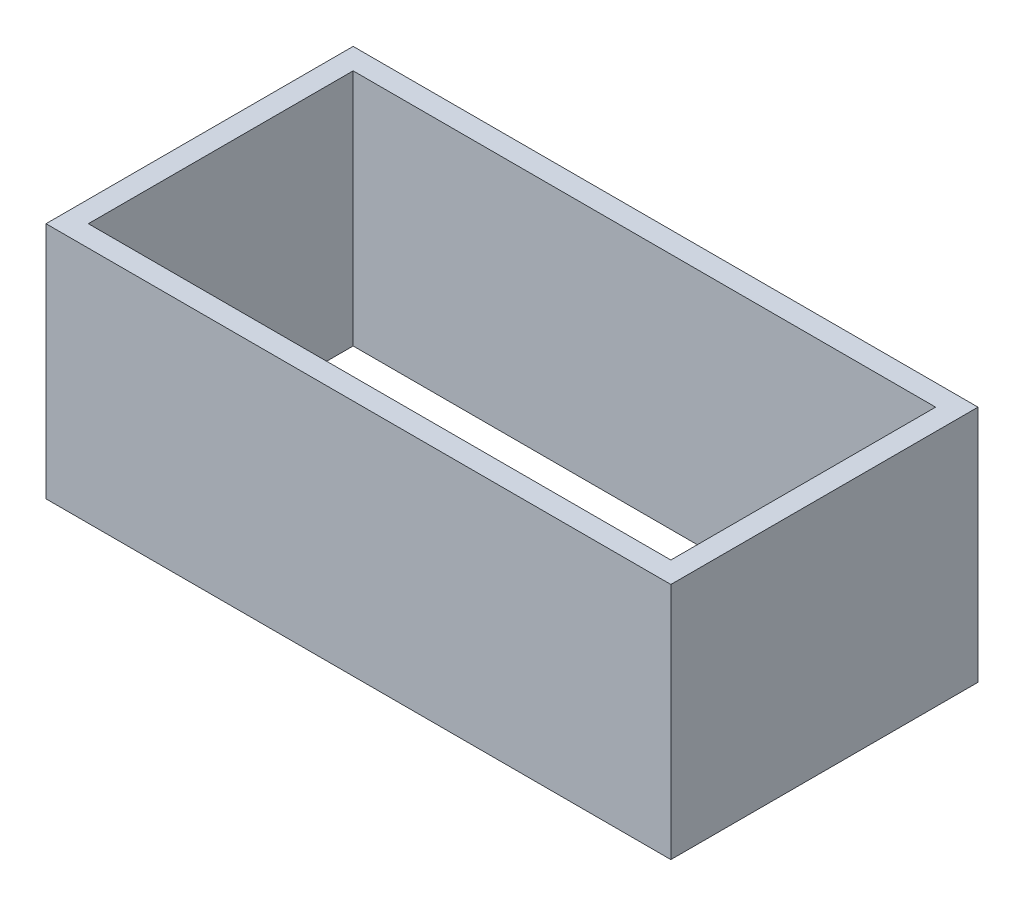
ISO-10303-21;
HEADER;
FILE_DESCRIPTION(('STEP AP214'),'2;1');
FILE_NAME('part.step','',(''),(''),'','','');
FILE_SCHEMA(('AUTOMOTIVE_DESIGN { 1 0 10303 214 1 1 1 1 }'));
ENDSEC;
DATA;
#1=APPLICATION_CONTEXT('core data for automotive mechanical design processes');
#2=APPLICATION_PROTOCOL_DEFINITION('international standard','automotive_design',2000,#1);
#3=PRODUCT_CONTEXT('',#1,'mechanical');
#4=PRODUCT('Part','Part','',(#3));
#5=PRODUCT_RELATED_PRODUCT_CATEGORY('part','',(#4));
#6=PRODUCT_DEFINITION_FORMATION('','',#4);
#7=PRODUCT_DEFINITION_CONTEXT('part definition',#1,'design');
#8=PRODUCT_DEFINITION('design','',#6,#7);
#9=PRODUCT_DEFINITION_SHAPE('','',#8);
#10=(LENGTH_UNIT() NAMED_UNIT(*) SI_UNIT(.MILLI.,.METRE.));
#11=(NAMED_UNIT(*) PLANE_ANGLE_UNIT() SI_UNIT($,.RADIAN.));
#12=(NAMED_UNIT(*) SI_UNIT($,.STERADIAN.) SOLID_ANGLE_UNIT());
#13=UNCERTAINTY_MEASURE_WITH_UNIT(LENGTH_MEASURE(1.E-05),#10,'distance_accuracy_value','');
#14=(GEOMETRIC_REPRESENTATION_CONTEXT(3) GLOBAL_UNCERTAINTY_ASSIGNED_CONTEXT((#13)) GLOBAL_UNIT_ASSIGNED_CONTEXT((#10,
#11,#12)) REPRESENTATION_CONTEXT('',''));
#15=CARTESIAN_POINT('',(0.,0.,0.));
#16=DIRECTION('',(0.,0.,1.));
#17=DIRECTION('',(1.,0.,0.));
#18=AXIS2_PLACEMENT_3D('',#15,#16,#17);
#19=CARTESIAN_POINT('',(0.,22.5,0.));
#20=DIRECTION('',(0.,-1.,0.));
#21=DIRECTION('',(0.,0.,-1.));
#22=AXIS2_PLACEMENT_3D('',#19,#20,#21);
#23=PLANE('',#22);
#24=DIRECTION('',(1.,0.,0.));
#25=VECTOR('',#24,1.);
#26=CARTESIAN_POINT('',(29.5,22.5,14.5));
#27=LINE('',#26,#25);
#28=CARTESIAN_POINT('',(-29.5,22.5,14.5));
#29=VERTEX_POINT('',#28);
#30=CARTESIAN_POINT('',(29.5,22.5,14.5));
#31=VERTEX_POINT('',#30);
#32=EDGE_CURVE('E134',#29,#31,#27,.T.);
#33=ORIENTED_EDGE('',*,*,#32,.T.);
#34=DIRECTION('',(0.,0.,-1.));
#35=VECTOR('',#34,1.);
#36=CARTESIAN_POINT('',(29.5,22.5,14.5));
#37=LINE('',#36,#35);
#38=CARTESIAN_POINT('',(29.5,22.5,-14.5));
#39=VERTEX_POINT('',#38);
#40=EDGE_CURVE('E137',#31,#39,#37,.T.);
#41=ORIENTED_EDGE('',*,*,#40,.T.);
#42=DIRECTION('',(-1.,0.,0.));
#43=VECTOR('',#42,1.);
#44=CARTESIAN_POINT('',(29.5,22.5,-14.5));
#45=LINE('',#44,#43);
#46=CARTESIAN_POINT('',(-29.5,22.5,-14.5));
#47=VERTEX_POINT('',#46);
#48=EDGE_CURVE('E140',#39,#47,#45,.T.);
#49=ORIENTED_EDGE('',*,*,#48,.T.);
#50=DIRECTION('',(0.,0.,1.));
#51=VECTOR('',#50,1.);
#52=CARTESIAN_POINT('',(-29.5,22.5,14.5));
#53=LINE('',#52,#51);
#54=EDGE_CURVE('E142',#47,#29,#53,.T.);
#55=ORIENTED_EDGE('',*,*,#54,.T.);
#56=EDGE_LOOP('',(#33,#41,#49,#55));
#57=FACE_BOUND('',#56,.T.);
#58=DIRECTION('',(0.,0.,1.));
#59=VECTOR('',#58,1.);
#60=CARTESIAN_POINT('',(-27.5,22.5,12.5));
#61=LINE('',#60,#59);
#62=CARTESIAN_POINT('',(-27.5,22.5,-12.5));
#63=VERTEX_POINT('',#62);
#64=CARTESIAN_POINT('',(-27.5,22.5,12.5));
#65=VERTEX_POINT('',#64);
#66=EDGE_CURVE('E98',#63,#65,#61,.T.);
#67=ORIENTED_EDGE('',*,*,#66,.F.);
#68=DIRECTION('',(-1.,0.,0.));
#69=VECTOR('',#68,1.);
#70=CARTESIAN_POINT('',(27.5,22.5,-12.5));
#71=LINE('',#70,#69);
#72=CARTESIAN_POINT('',(27.5,22.5,-12.5));
#73=VERTEX_POINT('',#72);
#74=EDGE_CURVE('E120',#73,#63,#71,.T.);
#75=ORIENTED_EDGE('',*,*,#74,.F.);
#76=DIRECTION('',(0.,0.,-1.));
#77=VECTOR('',#76,1.);
#78=CARTESIAN_POINT('',(27.5,22.5,12.5));
#79=LINE('',#78,#77);
#80=CARTESIAN_POINT('',(27.5,22.5,12.5));
#81=VERTEX_POINT('',#80);
#82=EDGE_CURVE('E118',#81,#73,#79,.T.);
#83=ORIENTED_EDGE('',*,*,#82,.F.);
#84=DIRECTION('',(1.,0.,0.));
#85=VECTOR('',#84,1.);
#86=CARTESIAN_POINT('',(27.5,22.5,12.5));
#87=LINE('',#86,#85);
#88=EDGE_CURVE('E106',#65,#81,#87,.T.);
#89=ORIENTED_EDGE('',*,*,#88,.F.);
#90=EDGE_LOOP('',(#67,#75,#83,#89));
#91=FACE_BOUND('',#90,.T.);
#92=ADVANCED_FACE('F33',(#57,#91),#23,.F.);
#93=CARTESIAN_POINT('',(0.,0.,0.));
#94=DIRECTION('',(0.,-1.,0.));
#95=DIRECTION('',(0.,0.,-1.));
#96=AXIS2_PLACEMENT_3D('',#93,#94,#95);
#97=PLANE('',#96);
#98=DIRECTION('',(1.,0.,0.));
#99=VECTOR('',#98,1.);
#100=CARTESIAN_POINT('',(29.5,0.,14.5));
#101=LINE('',#100,#99);
#102=CARTESIAN_POINT('',(-29.5,0.,14.5));
#103=VERTEX_POINT('',#102);
#104=CARTESIAN_POINT('',(29.5,0.,14.5));
#105=VERTEX_POINT('',#104);
#106=EDGE_CURVE('E114',#103,#105,#101,.T.);
#107=ORIENTED_EDGE('',*,*,#106,.F.);
#108=DIRECTION('',(0.,0.,1.));
#109=VECTOR('',#108,1.);
#110=CARTESIAN_POINT('',(-29.5,0.,14.5));
#111=LINE('',#110,#109);
#112=CARTESIAN_POINT('',(-29.5,0.,-14.5));
#113=VERTEX_POINT('',#112);
#114=EDGE_CURVE('E138',#113,#103,#111,.T.);
#115=ORIENTED_EDGE('',*,*,#114,.F.);
#116=DIRECTION('',(-1.,0.,0.));
#117=VECTOR('',#116,1.);
#118=CARTESIAN_POINT('',(29.5,0.,-14.5));
#119=LINE('',#118,#117);
#120=CARTESIAN_POINT('',(29.5,0.,-14.5));
#121=VERTEX_POINT('',#120);
#122=EDGE_CURVE('E149',#121,#113,#119,.T.);
#123=ORIENTED_EDGE('',*,*,#122,.F.);
#124=DIRECTION('',(0.,0.,-1.));
#125=VECTOR('',#124,1.);
#126=CARTESIAN_POINT('',(29.5,0.,14.5));
#127=LINE('',#126,#125);
#128=EDGE_CURVE('E147',#105,#121,#127,.T.);
#129=ORIENTED_EDGE('',*,*,#128,.F.);
#130=EDGE_LOOP('',(#107,#115,#123,#129));
#131=FACE_BOUND('',#130,.T.);
#132=DIRECTION('',(-1.,0.,0.));
#133=VECTOR('',#132,1.);
#134=CARTESIAN_POINT('',(27.5,0.,-12.5));
#135=LINE('',#134,#133);
#136=CARTESIAN_POINT('',(27.5,0.,-12.5));
#137=VERTEX_POINT('',#136);
#138=CARTESIAN_POINT('',(-27.5,0.,-12.5));
#139=VERTEX_POINT('',#138);
#140=EDGE_CURVE('E107',#137,#139,#135,.T.);
#141=ORIENTED_EDGE('',*,*,#140,.T.);
#142=DIRECTION('',(0.,0.,1.));
#143=VECTOR('',#142,1.);
#144=CARTESIAN_POINT('',(-27.5,0.,12.5));
#145=LINE('',#144,#143);
#146=CARTESIAN_POINT('',(-27.5,0.,12.5));
#147=VERTEX_POINT('',#146);
#148=EDGE_CURVE('E56',#139,#147,#145,.T.);
#149=ORIENTED_EDGE('',*,*,#148,.T.);
#150=DIRECTION('',(1.,0.,0.));
#151=VECTOR('',#150,1.);
#152=CARTESIAN_POINT('',(27.5,0.,12.5));
#153=LINE('',#152,#151);
#154=CARTESIAN_POINT('',(27.5,0.,12.5));
#155=VERTEX_POINT('',#154);
#156=EDGE_CURVE('E113',#147,#155,#153,.T.);
#157=ORIENTED_EDGE('',*,*,#156,.T.);
#158=DIRECTION('',(0.,0.,-1.));
#159=VECTOR('',#158,1.);
#160=CARTESIAN_POINT('',(27.5,0.,12.5));
#161=LINE('',#160,#159);
#162=EDGE_CURVE('E126',#155,#137,#161,.T.);
#163=ORIENTED_EDGE('',*,*,#162,.T.);
#164=EDGE_LOOP('',(#141,#149,#157,#163));
#165=FACE_BOUND('',#164,.T.);
#166=ADVANCED_FACE('F167',(#131,#165),#97,.T.);
#167=CARTESIAN_POINT('',(29.5,22.5,14.5));
#168=DIRECTION('',(0.,0.,-1.));
#169=DIRECTION('',(-1.,0.,0.));
#170=AXIS2_PLACEMENT_3D('',#167,#168,#169);
#171=PLANE('',#170);
#172=ORIENTED_EDGE('',*,*,#106,.T.);
#173=DIRECTION('',(0.,-1.,0.));
#174=VECTOR('',#173,1.);
#175=CARTESIAN_POINT('',(29.5,22.5,14.5));
#176=LINE('',#175,#174);
#177=EDGE_CURVE('E11',#31,#105,#176,.T.);
#178=ORIENTED_EDGE('',*,*,#177,.F.);
#179=ORIENTED_EDGE('',*,*,#32,.F.);
#180=DIRECTION('',(0.,-1.,0.));
#181=VECTOR('',#180,1.);
#182=CARTESIAN_POINT('',(-29.5,22.5,14.5));
#183=LINE('',#182,#181);
#184=EDGE_CURVE('E144',#29,#103,#183,.T.);
#185=ORIENTED_EDGE('',*,*,#184,.T.);
#186=EDGE_LOOP('',(#172,#178,#179,#185));
#187=FACE_BOUND('',#186,.T.);
#188=ADVANCED_FACE('F35',(#187),#171,.F.);
#189=CARTESIAN_POINT('',(29.5,22.5,14.5));
#190=DIRECTION('',(-1.,0.,0.));
#191=DIRECTION('',(0.,0.,1.));
#192=AXIS2_PLACEMENT_3D('',#189,#190,#191);
#193=PLANE('',#192);
#194=ORIENTED_EDGE('',*,*,#128,.T.);
#195=DIRECTION('',(0.,-1.,0.));
#196=VECTOR('',#195,1.);
#197=CARTESIAN_POINT('',(29.5,22.5,-14.5));
#198=LINE('',#197,#196);
#199=EDGE_CURVE('E41',#39,#121,#198,.T.);
#200=ORIENTED_EDGE('',*,*,#199,.F.);
#201=ORIENTED_EDGE('',*,*,#40,.F.);
#202=ORIENTED_EDGE('',*,*,#177,.T.);
#203=EDGE_LOOP('',(#194,#200,#201,#202));
#204=FACE_BOUND('',#203,.T.);
#205=ADVANCED_FACE('F177',(#204),#193,.F.);
#206=CARTESIAN_POINT('',(29.5,22.5,-14.5));
#207=DIRECTION('',(0.,0.,1.));
#208=DIRECTION('',(1.,0.,0.));
#209=AXIS2_PLACEMENT_3D('',#206,#207,#208);
#210=PLANE('',#209);
#211=ORIENTED_EDGE('',*,*,#122,.T.);
#212=DIRECTION('',(0.,-1.,0.));
#213=VECTOR('',#212,1.);
#214=CARTESIAN_POINT('',(-29.5,22.5,-14.5));
#215=LINE('',#214,#213);
#216=EDGE_CURVE('E154',#47,#113,#215,.T.);
#217=ORIENTED_EDGE('',*,*,#216,.F.);
#218=ORIENTED_EDGE('',*,*,#48,.F.);
#219=ORIENTED_EDGE('',*,*,#199,.T.);
#220=EDGE_LOOP('',(#211,#217,#218,#219));
#221=FACE_BOUND('',#220,.T.);
#222=ADVANCED_FACE('F161',(#221),#210,.F.);
#223=CARTESIAN_POINT('',(-29.5,22.5,14.5));
#224=DIRECTION('',(1.,0.,0.));
#225=DIRECTION('',(0.,0.,-1.));
#226=AXIS2_PLACEMENT_3D('',#223,#224,#225);
#227=PLANE('',#226);
#228=ORIENTED_EDGE('',*,*,#114,.T.);
#229=ORIENTED_EDGE('',*,*,#184,.F.);
#230=ORIENTED_EDGE('',*,*,#54,.F.);
#231=ORIENTED_EDGE('',*,*,#216,.T.);
#232=EDGE_LOOP('',(#228,#229,#230,#231));
#233=FACE_BOUND('',#232,.T.);
#234=ADVANCED_FACE('F171',(#233),#227,.F.);
#235=CARTESIAN_POINT('',(-27.5,22.5,12.5));
#236=DIRECTION('',(1.,0.,0.));
#237=DIRECTION('',(0.,0.,-1.));
#238=AXIS2_PLACEMENT_3D('',#235,#236,#237);
#239=PLANE('',#238);
#240=ORIENTED_EDGE('',*,*,#148,.F.);
#241=DIRECTION('',(0.,-1.,0.));
#242=VECTOR('',#241,1.);
#243=CARTESIAN_POINT('',(-27.5,22.5,-12.5));
#244=LINE('',#243,#242);
#245=EDGE_CURVE('E102',#63,#139,#244,.T.);
#246=ORIENTED_EDGE('',*,*,#245,.F.);
#247=ORIENTED_EDGE('',*,*,#66,.T.);
#248=DIRECTION('',(0.,-1.,0.));
#249=VECTOR('',#248,1.);
#250=CARTESIAN_POINT('',(-27.5,22.5,12.5));
#251=LINE('',#250,#249);
#252=EDGE_CURVE('E101',#65,#147,#251,.T.);
#253=ORIENTED_EDGE('',*,*,#252,.T.);
#254=EDGE_LOOP('',(#240,#246,#247,#253));
#255=FACE_BOUND('',#254,.T.);
#256=ADVANCED_FACE('F100',(#255),#239,.T.);
#257=CARTESIAN_POINT('',(27.5,22.5,12.5));
#258=DIRECTION('',(0.,0.,-1.));
#259=DIRECTION('',(-1.,0.,0.));
#260=AXIS2_PLACEMENT_3D('',#257,#258,#259);
#261=PLANE('',#260);
#262=ORIENTED_EDGE('',*,*,#156,.F.);
#263=ORIENTED_EDGE('',*,*,#252,.F.);
#264=ORIENTED_EDGE('',*,*,#88,.T.);
#265=DIRECTION('',(0.,-1.,0.));
#266=VECTOR('',#265,1.);
#267=CARTESIAN_POINT('',(27.5,22.5,12.5));
#268=LINE('',#267,#266);
#269=EDGE_CURVE('E115',#81,#155,#268,.T.);
#270=ORIENTED_EDGE('',*,*,#269,.T.);
#271=EDGE_LOOP('',(#262,#263,#264,#270));
#272=FACE_BOUND('',#271,.T.);
#273=ADVANCED_FACE('F110',(#272),#261,.T.);
#274=CARTESIAN_POINT('',(27.5,22.5,12.5));
#275=DIRECTION('',(-1.,0.,0.));
#276=DIRECTION('',(0.,0.,1.));
#277=AXIS2_PLACEMENT_3D('',#274,#275,#276);
#278=PLANE('',#277);
#279=ORIENTED_EDGE('',*,*,#162,.F.);
#280=ORIENTED_EDGE('',*,*,#269,.F.);
#281=ORIENTED_EDGE('',*,*,#82,.T.);
#282=DIRECTION('',(0.,-1.,0.));
#283=VECTOR('',#282,1.);
#284=CARTESIAN_POINT('',(27.5,22.5,-12.5));
#285=LINE('',#284,#283);
#286=EDGE_CURVE('E48',#73,#137,#285,.T.);
#287=ORIENTED_EDGE('',*,*,#286,.T.);
#288=EDGE_LOOP('',(#279,#280,#281,#287));
#289=FACE_BOUND('',#288,.T.);
#290=ADVANCED_FACE('F200',(#289),#278,.T.);
#291=CARTESIAN_POINT('',(27.5,22.5,-12.5));
#292=DIRECTION('',(0.,0.,1.));
#293=DIRECTION('',(1.,0.,0.));
#294=AXIS2_PLACEMENT_3D('',#291,#292,#293);
#295=PLANE('',#294);
#296=ORIENTED_EDGE('',*,*,#140,.F.);
#297=ORIENTED_EDGE('',*,*,#286,.F.);
#298=ORIENTED_EDGE('',*,*,#74,.T.);
#299=ORIENTED_EDGE('',*,*,#245,.T.);
#300=EDGE_LOOP('',(#296,#297,#298,#299));
#301=FACE_BOUND('',#300,.T.);
#302=ADVANCED_FACE('F204',(#301),#295,.T.);
#303=CLOSED_SHELL('',(#92,#166,#188,#205,#222,#234,#256,#273,#290,#302));
#304=MANIFOLD_SOLID_BREP('B2',#303);
#305=ADVANCED_BREP_SHAPE_REPRESENTATION('',(#18,#304),#14);
#306=SHAPE_DEFINITION_REPRESENTATION(#9,#305);
ENDSEC;
END-ISO-10303-21;
